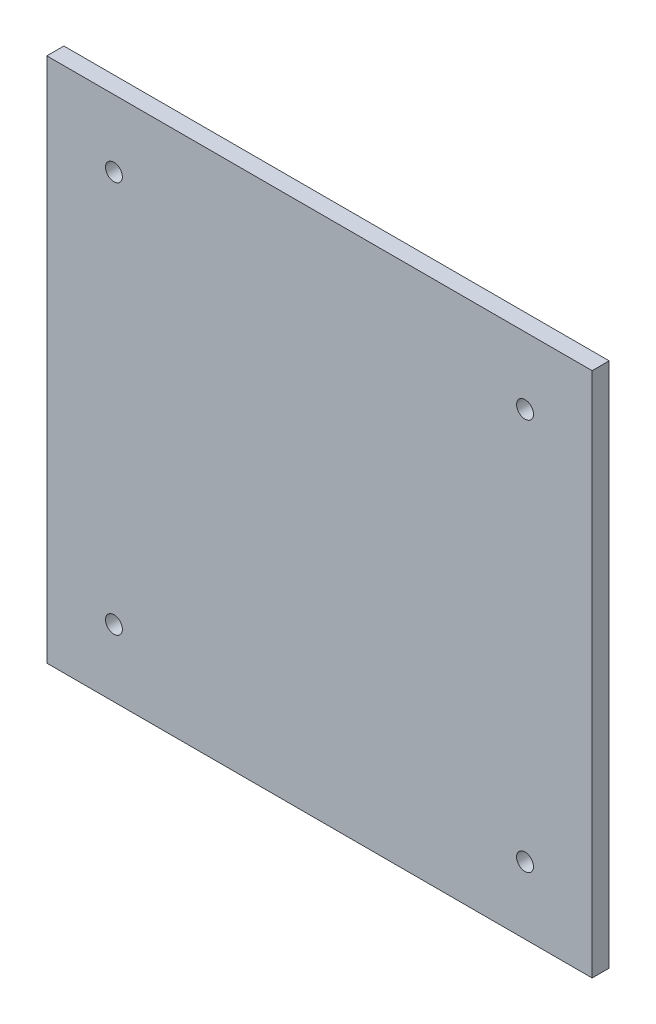
ISO-10303-21;
HEADER;
FILE_DESCRIPTION(('STEP AP214'),'2;1');
FILE_NAME('part.step','',(''),(''),'','','');
FILE_SCHEMA(('AUTOMOTIVE_DESIGN { 1 0 10303 214 1 1 1 1 }'));
ENDSEC;
DATA;
#1=APPLICATION_CONTEXT('core data for automotive mechanical design processes');
#2=APPLICATION_PROTOCOL_DEFINITION('international standard','automotive_design',2000,#1);
#3=PRODUCT_CONTEXT('',#1,'mechanical');
#4=PRODUCT('Part','Part','',(#3));
#5=PRODUCT_RELATED_PRODUCT_CATEGORY('part','',(#4));
#6=PRODUCT_DEFINITION_FORMATION('','',#4);
#7=PRODUCT_DEFINITION_CONTEXT('part definition',#1,'design');
#8=PRODUCT_DEFINITION('design','',#6,#7);
#9=PRODUCT_DEFINITION_SHAPE('','',#8);
#10=(LENGTH_UNIT() NAMED_UNIT(*) SI_UNIT(.MILLI.,.METRE.));
#11=(NAMED_UNIT(*) PLANE_ANGLE_UNIT() SI_UNIT($,.RADIAN.));
#12=(NAMED_UNIT(*) SI_UNIT($,.STERADIAN.) SOLID_ANGLE_UNIT());
#13=UNCERTAINTY_MEASURE_WITH_UNIT(LENGTH_MEASURE(1.E-05),#10,'distance_accuracy_value','');
#14=(GEOMETRIC_REPRESENTATION_CONTEXT(3) GLOBAL_UNCERTAINTY_ASSIGNED_CONTEXT((#13)) GLOBAL_UNIT_ASSIGNED_CONTEXT((#10,
#11,#12)) REPRESENTATION_CONTEXT('',''));
#15=CARTESIAN_POINT('',(0.,0.,0.));
#16=DIRECTION('',(0.,0.,1.));
#17=DIRECTION('',(1.,0.,0.));
#18=AXIS2_PLACEMENT_3D('',#15,#16,#17);
#19=CARTESIAN_POINT('',(50.799999922,-48.999999978,3.175));
#20=DIRECTION('',(-1.,0.,0.));
#21=DIRECTION('',(0.,0.,1.));
#22=AXIS2_PLACEMENT_3D('',#19,#20,#21);
#23=PLANE('',#22);
#24=DIRECTION('',(0.,1.,0.));
#25=VECTOR('',#24,1.);
#26=CARTESIAN_POINT('',(50.799999922,-48.999999978,0.));
#27=LINE('',#26,#25);
#28=CARTESIAN_POINT('',(50.799999922,-48.999999978,0.));
#29=VERTEX_POINT('',#28);
#30=CARTESIAN_POINT('',(50.799999922,48.999999978,0.));
#31=VERTEX_POINT('',#30);
#32=EDGE_CURVE('E98',#29,#31,#27,.T.);
#33=ORIENTED_EDGE('',*,*,#32,.T.);
#34=DIRECTION('',(0.,0.,-1.));
#35=VECTOR('',#34,1.);
#36=CARTESIAN_POINT('',(50.799999922,48.999999978,3.175));
#37=LINE('',#36,#35);
#38=CARTESIAN_POINT('',(50.799999922,48.999999978,3.175));
#39=VERTEX_POINT('',#38);
#40=EDGE_CURVE('E11',#39,#31,#37,.T.);
#41=ORIENTED_EDGE('',*,*,#40,.F.);
#42=DIRECTION('',(0.,1.,0.));
#43=VECTOR('',#42,1.);
#44=CARTESIAN_POINT('',(50.799999922,-48.999999978,3.175));
#45=LINE('',#44,#43);
#46=CARTESIAN_POINT('',(50.799999922,-48.999999978,3.175));
#47=VERTEX_POINT('',#46);
#48=EDGE_CURVE('E86',#47,#39,#45,.T.);
#49=ORIENTED_EDGE('',*,*,#48,.F.);
#50=DIRECTION('',(0.,0.,-1.));
#51=VECTOR('',#50,1.);
#52=CARTESIAN_POINT('',(50.799999922,-48.999999978,3.175));
#53=LINE('',#52,#51);
#54=EDGE_CURVE('E94',#47,#29,#53,.T.);
#55=ORIENTED_EDGE('',*,*,#54,.T.);
#56=EDGE_LOOP('',(#33,#41,#49,#55));
#57=FACE_BOUND('',#56,.T.);
#58=ADVANCED_FACE('F35',(#57),#23,.F.);
#59=CARTESIAN_POINT('',(-50.799999922,48.999999978,3.175));
#60=DIRECTION('',(0.,-1.,0.));
#61=DIRECTION('',(0.,0.,-1.));
#62=AXIS2_PLACEMENT_3D('',#59,#60,#61);
#63=PLANE('',#62);
#64=DIRECTION('',(-1.,0.,0.));
#65=VECTOR('',#64,1.);
#66=CARTESIAN_POINT('',(-50.799999922,48.999999978,0.));
#67=LINE('',#66,#65);
#68=CARTESIAN_POINT('',(-50.799999922,48.999999978,0.));
#69=VERTEX_POINT('',#68);
#70=EDGE_CURVE('E90',#31,#69,#67,.T.);
#71=ORIENTED_EDGE('',*,*,#70,.T.);
#72=DIRECTION('',(0.,0.,-1.));
#73=VECTOR('',#72,1.);
#74=CARTESIAN_POINT('',(-50.799999922,48.999999978,3.175));
#75=LINE('',#74,#73);
#76=CARTESIAN_POINT('',(-50.799999922,48.999999978,3.175));
#77=VERTEX_POINT('',#76);
#78=EDGE_CURVE('E43',#77,#69,#75,.T.);
#79=ORIENTED_EDGE('',*,*,#78,.F.);
#80=DIRECTION('',(-1.,0.,0.));
#81=VECTOR('',#80,1.);
#82=CARTESIAN_POINT('',(-50.799999922,48.999999978,3.175));
#83=LINE('',#82,#81);
#84=EDGE_CURVE('E81',#39,#77,#83,.T.);
#85=ORIENTED_EDGE('',*,*,#84,.F.);
#86=ORIENTED_EDGE('',*,*,#40,.T.);
#87=EDGE_LOOP('',(#71,#79,#85,#86));
#88=FACE_BOUND('',#87,.T.);
#89=ADVANCED_FACE('F89',(#88),#63,.F.);
#90=CARTESIAN_POINT('',(-50.799999922,-48.999999978,3.175));
#91=DIRECTION('',(1.,0.,0.));
#92=DIRECTION('',(0.,0.,-1.));
#93=AXIS2_PLACEMENT_3D('',#90,#91,#92);
#94=PLANE('',#93);
#95=DIRECTION('',(0.,-1.,0.));
#96=VECTOR('',#95,1.);
#97=CARTESIAN_POINT('',(-50.799999922,-48.999999978,0.));
#98=LINE('',#97,#96);
#99=CARTESIAN_POINT('',(-50.799999922,-48.999999978,0.));
#100=VERTEX_POINT('',#99);
#101=EDGE_CURVE('E68',#69,#100,#98,.T.);
#102=ORIENTED_EDGE('',*,*,#101,.T.);
#103=DIRECTION('',(0.,0.,-1.));
#104=VECTOR('',#103,1.);
#105=CARTESIAN_POINT('',(-50.799999922,-48.999999978,3.175));
#106=LINE('',#105,#104);
#107=CARTESIAN_POINT('',(-50.799999922,-48.999999978,3.175));
#108=VERTEX_POINT('',#107);
#109=EDGE_CURVE('E91',#108,#100,#106,.T.);
#110=ORIENTED_EDGE('',*,*,#109,.F.);
#111=DIRECTION('',(0.,-1.,0.));
#112=VECTOR('',#111,1.);
#113=CARTESIAN_POINT('',(-50.799999922,-48.999999978,3.175));
#114=LINE('',#113,#112);
#115=EDGE_CURVE('E84',#77,#108,#114,.T.);
#116=ORIENTED_EDGE('',*,*,#115,.F.);
#117=ORIENTED_EDGE('',*,*,#78,.T.);
#118=EDGE_LOOP('',(#102,#110,#116,#117));
#119=FACE_BOUND('',#118,.T.);
#120=ADVANCED_FACE('F92',(#119),#94,.F.);
#121=CARTESIAN_POINT('',(-50.799999922,-48.999999978,3.175));
#122=DIRECTION('',(0.,1.,0.));
#123=DIRECTION('',(0.,0.,1.));
#124=AXIS2_PLACEMENT_3D('',#121,#122,#123);
#125=PLANE('',#124);
#126=DIRECTION('',(1.,0.,0.));
#127=VECTOR('',#126,1.);
#128=CARTESIAN_POINT('',(-50.799999922,-48.999999978,0.));
#129=LINE('',#128,#127);
#130=EDGE_CURVE('E74',#100,#29,#129,.T.);
#131=ORIENTED_EDGE('',*,*,#130,.T.);
#132=ORIENTED_EDGE('',*,*,#54,.F.);
#133=DIRECTION('',(1.,0.,0.));
#134=VECTOR('',#133,1.);
#135=CARTESIAN_POINT('',(-50.799999922,-48.999999978,3.175));
#136=LINE('',#135,#134);
#137=EDGE_CURVE('E51',#108,#47,#136,.T.);
#138=ORIENTED_EDGE('',*,*,#137,.F.);
#139=ORIENTED_EDGE('',*,*,#109,.T.);
#140=EDGE_LOOP('',(#131,#132,#138,#139));
#141=FACE_BOUND('',#140,.T.);
#142=ADVANCED_FACE('F106',(#141),#125,.F.);
#143=CARTESIAN_POINT('',(0.,0.,3.175));
#144=DIRECTION('',(0.,0.,-1.));
#145=DIRECTION('',(-1.,0.,0.));
#146=AXIS2_PLACEMENT_3D('',#143,#144,#145);
#147=PLANE('',#146);
#148=CARTESIAN_POINT('',(-38.299999922,-36.499999978,3.175));
#149=DIRECTION('',(0.,0.,1.));
#150=DIRECTION('',(-1.,0.,0.));
#151=AXIS2_PLACEMENT_3D('',#148,#149,#150);
#152=CIRCLE('',#151,1.57500000000001);
#153=CARTESIAN_POINT('',(-39.874999922,-36.499999978,3.175));
#154=VERTEX_POINT('',#153);
#155=EDGE_CURVE('E130',#154,#154,#152,.T.);
#156=ORIENTED_EDGE('',*,*,#155,.F.);
#157=EDGE_LOOP('',(#156));
#158=FACE_BOUND('',#157,.T.);
#159=CARTESIAN_POINT('',(38.299999922,-36.499999978,3.175));
#160=DIRECTION('',(0.,0.,1.));
#161=DIRECTION('',(1.,0.,0.));
#162=AXIS2_PLACEMENT_3D('',#159,#160,#161);
#163=CIRCLE('',#162,1.57500000000001);
#164=CARTESIAN_POINT('',(39.874999922,-36.499999978,3.175));
#165=VERTEX_POINT('',#164);
#166=EDGE_CURVE('E124',#165,#165,#163,.T.);
#167=ORIENTED_EDGE('',*,*,#166,.F.);
#168=EDGE_LOOP('',(#167));
#169=FACE_BOUND('',#168,.T.);
#170=CARTESIAN_POINT('',(38.299999922,36.499999978,3.175));
#171=DIRECTION('',(0.,0.,1.));
#172=DIRECTION('',(-1.,0.,0.));
#173=AXIS2_PLACEMENT_3D('',#170,#171,#172);
#174=CIRCLE('',#173,1.57500000000001);
#175=CARTESIAN_POINT('',(36.724999922,36.499999978,3.175));
#176=VERTEX_POINT('',#175);
#177=EDGE_CURVE('E118',#176,#176,#174,.T.);
#178=ORIENTED_EDGE('',*,*,#177,.F.);
#179=EDGE_LOOP('',(#178));
#180=FACE_BOUND('',#179,.T.);
#181=CARTESIAN_POINT('',(-38.299999922,36.499999978,3.175));
#182=DIRECTION('',(0.,0.,1.));
#183=DIRECTION('',(1.,0.,0.));
#184=AXIS2_PLACEMENT_3D('',#181,#182,#183);
#185=CIRCLE('',#184,1.57500000000001);
#186=CARTESIAN_POINT('',(-36.724999922,36.499999978,3.175));
#187=VERTEX_POINT('',#186);
#188=EDGE_CURVE('E112',#187,#187,#185,.T.);
#189=ORIENTED_EDGE('',*,*,#188,.F.);
#190=EDGE_LOOP('',(#189));
#191=FACE_BOUND('',#190,.T.);
#192=ORIENTED_EDGE('',*,*,#48,.T.);
#193=ORIENTED_EDGE('',*,*,#84,.T.);
#194=ORIENTED_EDGE('',*,*,#115,.T.);
#195=ORIENTED_EDGE('',*,*,#137,.T.);
#196=EDGE_LOOP('',(#192,#193,#194,#195));
#197=FACE_BOUND('',#196,.T.);
#198=ADVANCED_FACE('F82',(#158,#169,#180,#191,#197),#147,.F.);
#199=CARTESIAN_POINT('',(0.,0.,0.));
#200=DIRECTION('',(0.,0.,-1.));
#201=DIRECTION('',(-1.,0.,0.));
#202=AXIS2_PLACEMENT_3D('',#199,#200,#201);
#203=PLANE('',#202);
#204=CARTESIAN_POINT('',(-38.299999922,-36.499999978,0.));
#205=DIRECTION('',(0.,0.,1.));
#206=DIRECTION('',(-1.,0.,0.));
#207=AXIS2_PLACEMENT_3D('',#204,#205,#206);
#208=CIRCLE('',#207,1.57500000000001);
#209=CARTESIAN_POINT('',(-39.874999922,-36.499999978,0.));
#210=VERTEX_POINT('',#209);
#211=EDGE_CURVE('E127',#210,#210,#208,.T.);
#212=ORIENTED_EDGE('',*,*,#211,.T.);
#213=EDGE_LOOP('',(#212));
#214=FACE_BOUND('',#213,.T.);
#215=CARTESIAN_POINT('',(38.299999922,-36.499999978,0.));
#216=DIRECTION('',(0.,0.,1.));
#217=DIRECTION('',(1.,0.,0.));
#218=AXIS2_PLACEMENT_3D('',#215,#216,#217);
#219=CIRCLE('',#218,1.57500000000001);
#220=CARTESIAN_POINT('',(39.874999922,-36.499999978,0.));
#221=VERTEX_POINT('',#220);
#222=EDGE_CURVE('E121',#221,#221,#219,.T.);
#223=ORIENTED_EDGE('',*,*,#222,.T.);
#224=EDGE_LOOP('',(#223));
#225=FACE_BOUND('',#224,.T.);
#226=CARTESIAN_POINT('',(38.299999922,36.499999978,0.));
#227=DIRECTION('',(0.,0.,1.));
#228=DIRECTION('',(-1.,0.,0.));
#229=AXIS2_PLACEMENT_3D('',#226,#227,#228);
#230=CIRCLE('',#229,1.57500000000001);
#231=CARTESIAN_POINT('',(36.724999922,36.499999978,0.));
#232=VERTEX_POINT('',#231);
#233=EDGE_CURVE('E115',#232,#232,#230,.T.);
#234=ORIENTED_EDGE('',*,*,#233,.T.);
#235=EDGE_LOOP('',(#234));
#236=FACE_BOUND('',#235,.T.);
#237=CARTESIAN_POINT('',(-38.299999922,36.499999978,0.));
#238=DIRECTION('',(0.,0.,1.));
#239=DIRECTION('',(1.,0.,0.));
#240=AXIS2_PLACEMENT_3D('',#237,#238,#239);
#241=CIRCLE('',#240,1.57500000000001);
#242=CARTESIAN_POINT('',(-36.724999922,36.499999978,0.));
#243=VERTEX_POINT('',#242);
#244=EDGE_CURVE('E101',#243,#243,#241,.T.);
#245=ORIENTED_EDGE('',*,*,#244,.T.);
#246=EDGE_LOOP('',(#245));
#247=FACE_BOUND('',#246,.T.);
#248=ORIENTED_EDGE('',*,*,#32,.F.);
#249=ORIENTED_EDGE('',*,*,#130,.F.);
#250=ORIENTED_EDGE('',*,*,#101,.F.);
#251=ORIENTED_EDGE('',*,*,#70,.F.);
#252=EDGE_LOOP('',(#248,#249,#250,#251));
#253=FACE_BOUND('',#252,.T.);
#254=ADVANCED_FACE('F109',(#214,#225,#236,#247,#253),#203,.T.);
#255=CARTESIAN_POINT('',(-38.299999922,36.499999978,0.));
#256=DIRECTION('',(0.,0.,1.));
#257=DIRECTION('',(1.,0.,0.));
#258=AXIS2_PLACEMENT_3D('',#255,#256,#257);
#259=CYLINDRICAL_SURFACE('',#258,1.57500000000001);
#260=ORIENTED_EDGE('',*,*,#244,.F.);
#261=EDGE_LOOP('',(#260));
#262=FACE_BOUND('',#261,.T.);
#263=ORIENTED_EDGE('',*,*,#188,.T.);
#264=EDGE_LOOP('',(#263));
#265=FACE_BOUND('',#264,.T.);
#266=ADVANCED_FACE('F154',(#262,#265),#259,.F.);
#267=CARTESIAN_POINT('',(38.299999922,36.499999978,0.));
#268=DIRECTION('',(0.,0.,1.));
#269=DIRECTION('',(1.,0.,0.));
#270=AXIS2_PLACEMENT_3D('',#267,#268,#269);
#271=CYLINDRICAL_SURFACE('',#270,1.57500000000001);
#272=ORIENTED_EDGE('',*,*,#233,.F.);
#273=EDGE_LOOP('',(#272));
#274=FACE_BOUND('',#273,.T.);
#275=ORIENTED_EDGE('',*,*,#177,.T.);
#276=EDGE_LOOP('',(#275));
#277=FACE_BOUND('',#276,.T.);
#278=ADVANCED_FACE('F156',(#274,#277),#271,.F.);
#279=CARTESIAN_POINT('',(38.299999922,-36.499999978,0.));
#280=DIRECTION('',(0.,0.,1.));
#281=DIRECTION('',(1.,0.,0.));
#282=AXIS2_PLACEMENT_3D('',#279,#280,#281);
#283=CYLINDRICAL_SURFACE('',#282,1.57500000000001);
#284=ORIENTED_EDGE('',*,*,#222,.F.);
#285=EDGE_LOOP('',(#284));
#286=FACE_BOUND('',#285,.T.);
#287=ORIENTED_EDGE('',*,*,#166,.T.);
#288=EDGE_LOOP('',(#287));
#289=FACE_BOUND('',#288,.T.);
#290=ADVANCED_FACE('F141',(#286,#289),#283,.F.);
#291=CARTESIAN_POINT('',(-38.299999922,-36.499999978,0.));
#292=DIRECTION('',(0.,0.,1.));
#293=DIRECTION('',(1.,0.,0.));
#294=AXIS2_PLACEMENT_3D('',#291,#292,#293);
#295=CYLINDRICAL_SURFACE('',#294,1.57500000000001);
#296=ORIENTED_EDGE('',*,*,#211,.F.);
#297=EDGE_LOOP('',(#296));
#298=FACE_BOUND('',#297,.T.);
#299=ORIENTED_EDGE('',*,*,#155,.T.);
#300=EDGE_LOOP('',(#299));
#301=FACE_BOUND('',#300,.T.);
#302=ADVANCED_FACE('F138',(#298,#301),#295,.F.);
#303=CLOSED_SHELL('',(#58,#89,#120,#142,#198,#254,#266,#278,#290,#302));
#304=MANIFOLD_SOLID_BREP('B2',#303);
#305=ADVANCED_BREP_SHAPE_REPRESENTATION('',(#18,#304),#14);
#306=SHAPE_DEFINITION_REPRESENTATION(#9,#305);
ENDSEC;
END-ISO-10303-21;
